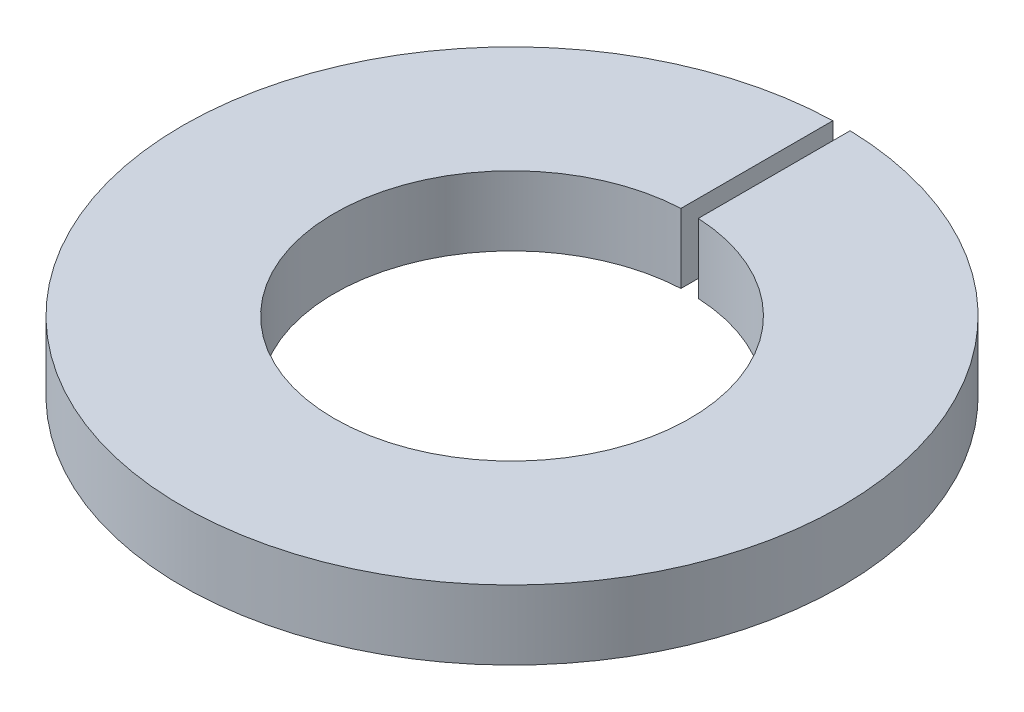
ISO-10303-21;
HEADER;
FILE_DESCRIPTION(('STEP AP214'),'2;1');
FILE_NAME('part.step','',(''),(''),'','','');
FILE_SCHEMA(('AUTOMOTIVE_DESIGN { 1 0 10303 214 1 1 1 1 }'));
ENDSEC;
DATA;
#1=APPLICATION_CONTEXT('core data for automotive mechanical design processes');
#2=APPLICATION_PROTOCOL_DEFINITION('international standard','automotive_design',2000,#1);
#3=PRODUCT_CONTEXT('',#1,'mechanical');
#4=PRODUCT('Part','Part','',(#3));
#5=PRODUCT_RELATED_PRODUCT_CATEGORY('part','',(#4));
#6=PRODUCT_DEFINITION_FORMATION('','',#4);
#7=PRODUCT_DEFINITION_CONTEXT('part definition',#1,'design');
#8=PRODUCT_DEFINITION('design','',#6,#7);
#9=PRODUCT_DEFINITION_SHAPE('','',#8);
#10=(LENGTH_UNIT() NAMED_UNIT(*) SI_UNIT(.MILLI.,.METRE.));
#11=(NAMED_UNIT(*) PLANE_ANGLE_UNIT() SI_UNIT($,.RADIAN.));
#12=(NAMED_UNIT(*) SI_UNIT($,.STERADIAN.) SOLID_ANGLE_UNIT());
#13=UNCERTAINTY_MEASURE_WITH_UNIT(LENGTH_MEASURE(1.E-05),#10,'distance_accuracy_value','');
#14=(GEOMETRIC_REPRESENTATION_CONTEXT(3) GLOBAL_UNCERTAINTY_ASSIGNED_CONTEXT((#13)) GLOBAL_UNIT_ASSIGNED_CONTEXT((#10,
#11,#12)) REPRESENTATION_CONTEXT('',''));
#15=CARTESIAN_POINT('',(0.,0.,0.));
#16=DIRECTION('',(0.,0.,1.));
#17=DIRECTION('',(1.,0.,0.));
#18=AXIS2_PLACEMENT_3D('',#15,#16,#17);
#19=CARTESIAN_POINT('',(0.,0.8,0.));
#20=DIRECTION('',(0.,-1.,0.));
#21=DIRECTION('',(0.,0.,-1.));
#22=AXIS2_PLACEMENT_3D('',#19,#20,#21);
#23=CYLINDRICAL_SURFACE('',#22,2.05);
#24=CARTESIAN_POINT('',(0.,0.,0.));
#25=DIRECTION('',(0.,-1.,0.));
#26=DIRECTION('',(0.,0.,1.));
#27=AXIS2_PLACEMENT_3D('',#24,#25,#26);
#28=CIRCLE('',#27,2.05);
#29=CARTESIAN_POINT('',(0.0999999999999994,0.,-2.04755952294433));
#30=VERTEX_POINT('',#29);
#31=CARTESIAN_POINT('',(-0.100000000000001,0.,-2.04755952294433));
#32=VERTEX_POINT('',#31);
#33=EDGE_CURVE('E107',#30,#32,#28,.T.);
#34=ORIENTED_EDGE('',*,*,#33,.T.);
#35=DIRECTION('',(0.,-1.,0.));
#36=VECTOR('',#35,1.);
#37=CARTESIAN_POINT('',(-0.100000000000001,0.8,-2.04755952294433));
#38=LINE('',#37,#36);
#39=CARTESIAN_POINT('',(-0.100000000000001,0.8,-2.04755952294433));
#40=VERTEX_POINT('',#39);
#41=EDGE_CURVE('E11',#40,#32,#38,.T.);
#42=ORIENTED_EDGE('',*,*,#41,.F.);
#43=CARTESIAN_POINT('',(0.,0.8,0.));
#44=DIRECTION('',(0.,-1.,0.));
#45=DIRECTION('',(0.,0.,1.));
#46=AXIS2_PLACEMENT_3D('',#43,#44,#45);
#47=CIRCLE('',#46,2.05);
#48=CARTESIAN_POINT('',(0.0999999999999994,0.8,-2.04755952294433));
#49=VERTEX_POINT('',#48);
#50=EDGE_CURVE('E91',#49,#40,#47,.T.);
#51=ORIENTED_EDGE('',*,*,#50,.F.);
#52=DIRECTION('',(0.,-1.,0.));
#53=VECTOR('',#52,1.);
#54=CARTESIAN_POINT('',(0.0999999999999994,0.8,-2.04755952294433));
#55=LINE('',#54,#53);
#56=EDGE_CURVE('E103',#49,#30,#55,.T.);
#57=ORIENTED_EDGE('',*,*,#56,.T.);
#58=EDGE_LOOP('',(#34,#42,#51,#57));
#59=FACE_BOUND('',#58,.T.);
#60=ADVANCED_FACE('F39',(#59),#23,.F.);
#61=CARTESIAN_POINT('',(-0.1,0.8,-3.79868398264452));
#62=DIRECTION('',(-1.,0.,0.));
#63=DIRECTION('',(0.,0.,1.));
#64=AXIS2_PLACEMENT_3D('',#61,#62,#63);
#65=PLANE('',#64);
#66=DIRECTION('',(0.,0.,-1.));
#67=VECTOR('',#66,1.);
#68=CARTESIAN_POINT('',(-0.1,0.,-3.79868398264452));
#69=LINE('',#68,#67);
#70=CARTESIAN_POINT('',(-0.1,0.,-3.79868398264452));
#71=VERTEX_POINT('',#70);
#72=EDGE_CURVE('E96',#32,#71,#69,.T.);
#73=ORIENTED_EDGE('',*,*,#72,.T.);
#74=DIRECTION('',(0.,-1.,0.));
#75=VECTOR('',#74,1.);
#76=CARTESIAN_POINT('',(-0.1,0.8,-3.79868398264452));
#77=LINE('',#76,#75);
#78=CARTESIAN_POINT('',(-0.1,0.8,-3.79868398264452));
#79=VERTEX_POINT('',#78);
#80=EDGE_CURVE('E48',#79,#71,#77,.T.);
#81=ORIENTED_EDGE('',*,*,#80,.F.);
#82=DIRECTION('',(0.,0.,-1.));
#83=VECTOR('',#82,1.);
#84=CARTESIAN_POINT('',(-0.1,0.8,-3.79868398264452));
#85=LINE('',#84,#83);
#86=EDGE_CURVE('E86',#40,#79,#85,.T.);
#87=ORIENTED_EDGE('',*,*,#86,.F.);
#88=ORIENTED_EDGE('',*,*,#41,.T.);
#89=EDGE_LOOP('',(#73,#81,#87,#88));
#90=FACE_BOUND('',#89,.T.);
#91=ADVANCED_FACE('F95',(#90),#65,.F.);
#92=CARTESIAN_POINT('',(0.,0.8,0.));
#93=DIRECTION('',(0.,-1.,0.));
#94=DIRECTION('',(0.,0.,-1.));
#95=AXIS2_PLACEMENT_3D('',#92,#93,#94);
#96=CYLINDRICAL_SURFACE('',#95,3.8);
#97=CARTESIAN_POINT('',(0.,0.,0.));
#98=DIRECTION('',(0.,1.,0.));
#99=DIRECTION('',(0.,0.,1.));
#100=AXIS2_PLACEMENT_3D('',#97,#98,#99);
#101=CIRCLE('',#100,3.8);
#102=CARTESIAN_POINT('',(0.100000000000004,0.,-3.79868398264452));
#103=VERTEX_POINT('',#102);
#104=EDGE_CURVE('E73',#71,#103,#101,.T.);
#105=ORIENTED_EDGE('',*,*,#104,.T.);
#106=DIRECTION('',(0.,-1.,0.));
#107=VECTOR('',#106,1.);
#108=CARTESIAN_POINT('',(0.100000000000004,0.8,-3.79868398264452));
#109=LINE('',#108,#107);
#110=CARTESIAN_POINT('',(0.100000000000004,0.8,-3.79868398264452));
#111=VERTEX_POINT('',#110);
#112=EDGE_CURVE('E98',#111,#103,#109,.T.);
#113=ORIENTED_EDGE('',*,*,#112,.F.);
#114=CARTESIAN_POINT('',(0.,0.8,0.));
#115=DIRECTION('',(0.,1.,0.));
#116=DIRECTION('',(0.,0.,1.));
#117=AXIS2_PLACEMENT_3D('',#114,#115,#116);
#118=CIRCLE('',#117,3.8);
#119=EDGE_CURVE('E89',#79,#111,#118,.T.);
#120=ORIENTED_EDGE('',*,*,#119,.F.);
#121=ORIENTED_EDGE('',*,*,#80,.T.);
#122=EDGE_LOOP('',(#105,#113,#120,#121));
#123=FACE_BOUND('',#122,.T.);
#124=ADVANCED_FACE('F99',(#123),#96,.T.);
#125=CARTESIAN_POINT('',(0.1,0.8,-3.79868398264452));
#126=DIRECTION('',(1.,0.,0.));
#127=DIRECTION('',(0.,0.,-1.));
#128=AXIS2_PLACEMENT_3D('',#125,#126,#127);
#129=PLANE('',#128);
#130=DIRECTION('',(0.,0.,1.));
#131=VECTOR('',#130,1.);
#132=CARTESIAN_POINT('',(0.1,0.,-3.79868398264452));
#133=LINE('',#132,#131);
#134=EDGE_CURVE('E79',#103,#30,#133,.T.);
#135=ORIENTED_EDGE('',*,*,#134,.T.);
#136=ORIENTED_EDGE('',*,*,#56,.F.);
#137=DIRECTION('',(0.,0.,1.));
#138=VECTOR('',#137,1.);
#139=CARTESIAN_POINT('',(0.1,0.8,-3.79868398264452));
#140=LINE('',#139,#138);
#141=EDGE_CURVE('E56',#111,#49,#140,.T.);
#142=ORIENTED_EDGE('',*,*,#141,.F.);
#143=ORIENTED_EDGE('',*,*,#112,.T.);
#144=EDGE_LOOP('',(#135,#136,#142,#143));
#145=FACE_BOUND('',#144,.T.);
#146=ADVANCED_FACE('F120',(#145),#129,.F.);
#147=CARTESIAN_POINT('',(0.,0.8,0.));
#148=DIRECTION('',(0.,1.,0.));
#149=DIRECTION('',(0.,0.,1.));
#150=AXIS2_PLACEMENT_3D('',#147,#148,#149);
#151=PLANE('',#150);
#152=ORIENTED_EDGE('',*,*,#50,.T.);
#153=ORIENTED_EDGE('',*,*,#86,.T.);
#154=ORIENTED_EDGE('',*,*,#119,.T.);
#155=ORIENTED_EDGE('',*,*,#141,.T.);
#156=EDGE_LOOP('',(#152,#153,#154,#155));
#157=FACE_BOUND('',#156,.T.);
#158=ADVANCED_FACE('F87',(#157),#151,.T.);
#159=CARTESIAN_POINT('',(0.,0.,0.));
#160=DIRECTION('',(0.,1.,0.));
#161=DIRECTION('',(0.,0.,1.));
#162=AXIS2_PLACEMENT_3D('',#159,#160,#161);
#163=PLANE('',#162);
#164=ORIENTED_EDGE('',*,*,#33,.F.);
#165=ORIENTED_EDGE('',*,*,#134,.F.);
#166=ORIENTED_EDGE('',*,*,#104,.F.);
#167=ORIENTED_EDGE('',*,*,#72,.F.);
#168=EDGE_LOOP('',(#164,#165,#166,#167));
#169=FACE_BOUND('',#168,.T.);
#170=ADVANCED_FACE('F123',(#169),#163,.F.);
#171=CLOSED_SHELL('',(#60,#91,#124,#146,#158,#170));
#172=MANIFOLD_SOLID_BREP('B2',#171);
#173=ADVANCED_BREP_SHAPE_REPRESENTATION('',(#18,#172),#14);
#174=SHAPE_DEFINITION_REPRESENTATION(#9,#173);
ENDSEC;
END-ISO-10303-21;
